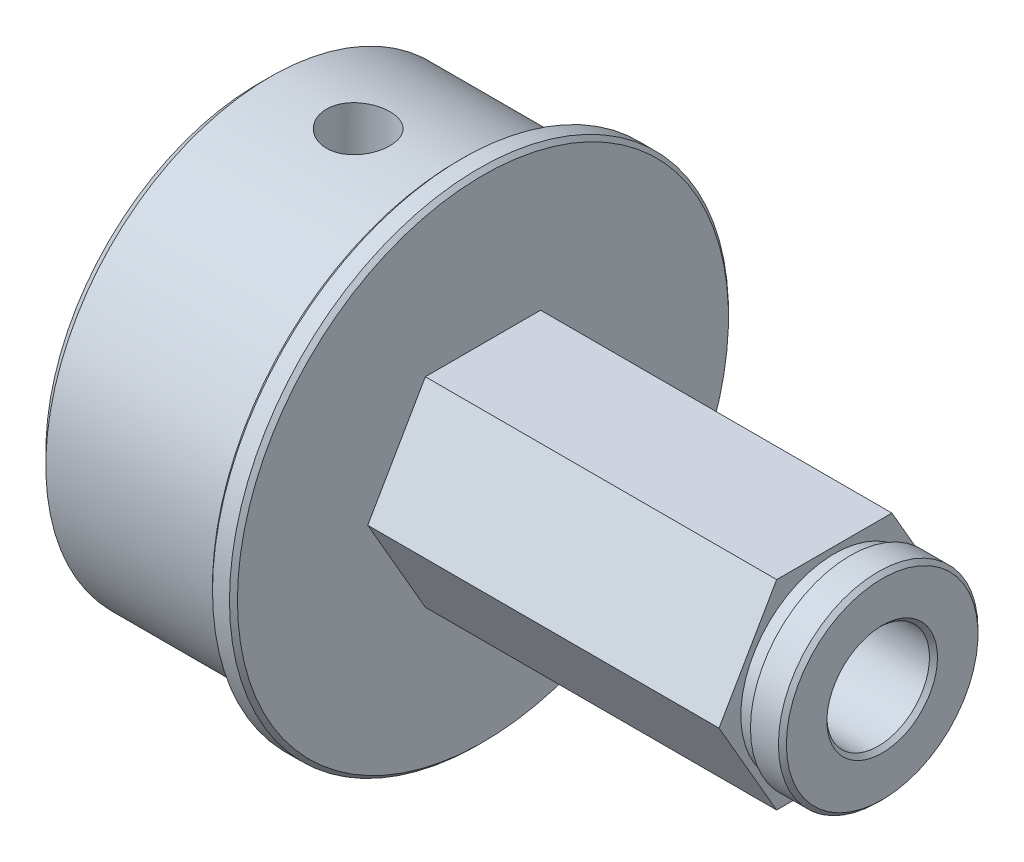
ISO-10303-21;
HEADER;
FILE_DESCRIPTION(('STEP AP214'),'2;1');
FILE_NAME('part.step','',(''),(''),'','','');
FILE_SCHEMA(('AUTOMOTIVE_DESIGN { 1 0 10303 214 1 1 1 1 }'));
ENDSEC;
DATA;
#1=APPLICATION_CONTEXT('core data for automotive mechanical design processes');
#2=APPLICATION_PROTOCOL_DEFINITION('international standard','automotive_design',2000,#1);
#3=PRODUCT_CONTEXT('',#1,'mechanical');
#4=PRODUCT('Part','Part','',(#3));
#5=PRODUCT_RELATED_PRODUCT_CATEGORY('part','',(#4));
#6=PRODUCT_DEFINITION_FORMATION('','',#4);
#7=PRODUCT_DEFINITION_CONTEXT('part definition',#1,'design');
#8=PRODUCT_DEFINITION('design','',#6,#7);
#9=PRODUCT_DEFINITION_SHAPE('','',#8);
#10=(LENGTH_UNIT() NAMED_UNIT(*) SI_UNIT(.MILLI.,.METRE.));
#11=(NAMED_UNIT(*) PLANE_ANGLE_UNIT() SI_UNIT($,.RADIAN.));
#12=(NAMED_UNIT(*) SI_UNIT($,.STERADIAN.) SOLID_ANGLE_UNIT());
#13=UNCERTAINTY_MEASURE_WITH_UNIT(LENGTH_MEASURE(1.E-05),#10,'distance_accuracy_value','');
#14=(GEOMETRIC_REPRESENTATION_CONTEXT(3) GLOBAL_UNCERTAINTY_ASSIGNED_CONTEXT((#13)) GLOBAL_UNIT_ASSIGNED_CONTEXT((#10,
#11,#12)) REPRESENTATION_CONTEXT('',''));
#15=CARTESIAN_POINT('',(0.,0.,0.));
#16=DIRECTION('',(0.,0.,1.));
#17=DIRECTION('',(1.,0.,0.));
#18=AXIS2_PLACEMENT_3D('',#15,#16,#17);
#19=CARTESIAN_POINT('',(26.9875,0.,0.));
#20=DIRECTION('',(1.,0.,0.));
#21=DIRECTION('',(0.,0.,-1.));
#22=AXIS2_PLACEMENT_3D('',#19,#20,#21);
#23=CYLINDRICAL_SURFACE('',#22,3.2639);
#24=CARTESIAN_POINT('',(-12.4460000000113,0.,0.));
#25=DIRECTION('',(-1.,0.,0.));
#26=DIRECTION('',(0.,0.,1.));
#27=AXIS2_PLACEMENT_3D('',#24,#25,#26);
#28=CIRCLE('',#27,3.26390000009269);
#29=CARTESIAN_POINT('',(-12.4460000000113,0.,3.26390000009269));
#30=VERTEX_POINT('',#29);
#31=EDGE_CURVE('E94',#30,#30,#28,.T.);
#32=ORIENTED_EDGE('',*,*,#31,.T.);
#33=EDGE_LOOP('',(#32));
#34=FACE_BOUND('',#33,.T.);
#35=CARTESIAN_POINT('',(26.7335000000344,0.,0.));
#36=DIRECTION('',(1.,0.,0.));
#37=DIRECTION('',(0.,0.,-1.));
#38=AXIS2_PLACEMENT_3D('',#35,#36,#37);
#39=CIRCLE('',#38,3.263899999979);
#40=CARTESIAN_POINT('',(26.7335000000344,0.,-3.263899999979));
#41=VERTEX_POINT('',#40);
#42=EDGE_CURVE('E91',#41,#41,#39,.T.);
#43=ORIENTED_EDGE('',*,*,#42,.T.);
#44=EDGE_LOOP('',(#43));
#45=FACE_BOUND('',#44,.T.);
#46=ADVANCED_FACE('F16',(#34,#45),#23,.F.);
#47=CARTESIAN_POINT('',(-12.6999999999953,0.,0.));
#48=DIRECTION('',(-1.,0.,0.));
#49=DIRECTION('',(0.,0.,1.));
#50=AXIS2_PLACEMENT_3D('',#47,#48,#49);
#51=CONICAL_SURFACE('',#50,3.51790000007668,0.785398163397448);
#52=CARTESIAN_POINT('',(-12.6999999999953,0.,0.));
#53=DIRECTION('',(-1.,0.,0.));
#54=DIRECTION('',(0.,0.,1.));
#55=AXIS2_PLACEMENT_3D('',#52,#53,#54);
#56=CIRCLE('',#55,3.51790000007668);
#57=CARTESIAN_POINT('',(-12.6999999999953,0.,3.51790000007668));
#58=VERTEX_POINT('',#57);
#59=EDGE_CURVE('E19',#58,#58,#56,.T.);
#60=ORIENTED_EDGE('',*,*,#59,.T.);
#61=EDGE_LOOP('',(#60));
#62=FACE_BOUND('',#61,.T.);
#63=ORIENTED_EDGE('',*,*,#31,.F.);
#64=EDGE_LOOP('',(#63));
#65=FACE_BOUND('',#64,.T.);
#66=ADVANCED_FACE('F256',(#62,#65),#51,.F.);
#67=CARTESIAN_POINT('',(26.9874999999047,0.,0.));
#68=DIRECTION('',(1.,0.,0.));
#69=DIRECTION('',(0.,0.,-1.));
#70=AXIS2_PLACEMENT_3D('',#67,#68,#69);
#71=CONICAL_SURFACE('',#70,3.51789999990615,0.785398163397448);
#72=ORIENTED_EDGE('',*,*,#42,.F.);
#73=EDGE_LOOP('',(#72));
#74=FACE_BOUND('',#73,.T.);
#75=CARTESIAN_POINT('',(26.9875000000184,0.,0.));
#76=DIRECTION('',(1.,0.,0.));
#77=DIRECTION('',(0.,0.,-1.));
#78=AXIS2_PLACEMENT_3D('',#75,#76,#77);
#79=CIRCLE('',#78,3.51790000001984);
#80=CARTESIAN_POINT('',(26.9875000000184,0.,-3.51790000001984));
#81=VERTEX_POINT('',#80);
#82=EDGE_CURVE('E83',#81,#81,#79,.F.);
#83=ORIENTED_EDGE('',*,*,#82,.F.);
#84=EDGE_LOOP('',(#83));
#85=FACE_BOUND('',#84,.T.);
#86=ADVANCED_FACE('F76',(#74,#85),#71,.F.);
#87=CARTESIAN_POINT('',(-6.35,-6.33729999992738,0.));
#88=DIRECTION('',(0.,-1.,0.));
#89=DIRECTION('',(0.,0.,-1.));
#90=AXIS2_PLACEMENT_3D('',#87,#88,#89);
#91=CONICAL_SURFACE('',#90,2.0192999998585,1.02974425857673);
#92=CARTESIAN_POINT('',(-6.35,-5.12398215195731,-5.68426412100906E-11));
#93=VERTEX_POINT('',#92);
#94=VERTEX_LOOP('',#93);
#95=FACE_BOUND('',#94,.T.);
#96=CARTESIAN_POINT('',(-6.35,-6.3373,0.));
#97=DIRECTION('',(0.,-1.,0.));
#98=DIRECTION('',(0.,0.,-1.));
#99=AXIS2_PLACEMENT_3D('',#96,#97,#98);
#100=CIRCLE('',#99,2.01929999999999);
#101=CARTESIAN_POINT('',(-6.35,-6.3373,-2.01929999999999));
#102=VERTEX_POINT('',#101);
#103=EDGE_CURVE('E80',#102,#102,#100,.T.);
#104=ORIENTED_EDGE('',*,*,#103,.T.);
#105=EDGE_LOOP('',(#104));
#106=FACE_BOUND('',#105,.T.);
#107=ADVANCED_FACE('F72',(#95,#106),#91,.F.);
#108=CARTESIAN_POINT('',(-6.35,6.33729999992738,0.));
#109=DIRECTION('',(0.,1.,0.));
#110=DIRECTION('',(0.,0.,1.));
#111=AXIS2_PLACEMENT_3D('',#108,#109,#110);
#112=CONICAL_SURFACE('',#111,2.0192999998585,1.02974425857673);
#113=CARTESIAN_POINT('',(-6.35,5.12398215195731,5.68441965115255E-11));
#114=VERTEX_POINT('',#113);
#115=VERTEX_LOOP('',#114);
#116=FACE_BOUND('',#115,.T.);
#117=CARTESIAN_POINT('',(-6.35,6.3373,0.));
#118=DIRECTION('',(0.,1.,0.));
#119=DIRECTION('',(0.,0.,1.));
#120=AXIS2_PLACEMENT_3D('',#117,#118,#119);
#121=CIRCLE('',#120,2.01929999999999);
#122=CARTESIAN_POINT('',(-6.35,6.3373,2.01929999999999));
#123=VERTEX_POINT('',#122);
#124=EDGE_CURVE('E82',#123,#123,#121,.T.);
#125=ORIENTED_EDGE('',*,*,#124,.T.);
#126=EDGE_LOOP('',(#125));
#127=FACE_BOUND('',#126,.T.);
#128=ADVANCED_FACE('F75',(#116,#127),#112,.F.);
#129=CARTESIAN_POINT('',(-12.7,0.,0.));
#130=DIRECTION('',(1.,0.,0.));
#131=DIRECTION('',(0.,0.,-1.));
#132=AXIS2_PLACEMENT_3D('',#129,#130,#131);
#133=PLANE('',#132);
#134=ORIENTED_EDGE('',*,*,#59,.F.);
#135=EDGE_LOOP('',(#134));
#136=FACE_BOUND('',#135,.T.);
#137=CARTESIAN_POINT('',(-12.7,0.,0.));
#138=DIRECTION('',(1.,0.,0.));
#139=DIRECTION('',(0.,0.,-1.));
#140=AXIS2_PLACEMENT_3D('',#137,#138,#139);
#141=CIRCLE('',#140,13.5255);
#142=CARTESIAN_POINT('',(-12.7,0.,-13.5255));
#143=VERTEX_POINT('',#142);
#144=EDGE_CURVE('E86',#143,#143,#141,.T.);
#145=ORIENTED_EDGE('',*,*,#144,.F.);
#146=EDGE_LOOP('',(#145));
#147=FACE_BOUND('',#146,.T.);
#148=ADVANCED_FACE('F241',(#136,#147),#133,.F.);
#149=CARTESIAN_POINT('',(26.9875,0.,0.));
#150=DIRECTION('',(1.,0.,0.));
#151=DIRECTION('',(0.,0.,-1.));
#152=AXIS2_PLACEMENT_3D('',#149,#150,#151);
#153=PLANE('',#152);
#154=ORIENTED_EDGE('',*,*,#82,.T.);
#155=EDGE_LOOP('',(#154));
#156=FACE_BOUND('',#155,.T.);
#157=CARTESIAN_POINT('',(26.9874999999615,0.,0.));
#158=DIRECTION('',(-1.,0.,0.));
#159=DIRECTION('',(0.,0.,1.));
#160=AXIS2_PLACEMENT_3D('',#157,#158,#159);
#161=CIRCLE('',#160,6.09600000001365);
#162=CARTESIAN_POINT('',(26.9874999999615,0.,6.09600000001365));
#163=VERTEX_POINT('',#162);
#164=EDGE_CURVE('E233',#163,#163,#161,.T.);
#165=ORIENTED_EDGE('',*,*,#164,.F.);
#166=EDGE_LOOP('',(#165));
#167=FACE_BOUND('',#166,.T.);
#168=ADVANCED_FACE('F243',(#156,#167),#153,.T.);
#169=CARTESIAN_POINT('',(-6.35,-14.2875,0.));
#170=DIRECTION('',(0.,-1.,0.));
#171=DIRECTION('',(0.,0.,-1.));
#172=AXIS2_PLACEMENT_3D('',#169,#170,#171);
#173=CYLINDRICAL_SURFACE('',#172,2.01929999999999);
#174=CARTESIAN_POINT('',(-6.35,-14.144082994666,-2.01929999999999));
#175=CARTESIAN_POINT('',(-6.46270978043252,-14.1440848572454,-2.01929494830352));
#176=CARTESIAN_POINT('',(-6.57556587894467,-14.1454458805024,-2.00982386080186));
#177=CARTESIAN_POINT('',(-6.7982088924763,-14.1507430375104,-1.97217534297388));
#178=CARTESIAN_POINT('',(-6.90798898861305,-14.1546844828974,-1.94395932562443));
#179=CARTESIAN_POINT('',(-7.12110470893202,-14.1646874218911,-1.86967410443429));
#180=CARTESIAN_POINT('',(-7.22444753490229,-14.1707464942905,-1.82362528341692));
#181=CARTESIAN_POINT('',(-7.42189406589667,-14.1842985714464,-1.71502478847225));
#182=CARTESIAN_POINT('',(-7.51600143849081,-14.1917910034744,-1.6524797022028));
#183=CARTESIAN_POINT('',(-7.69303462417489,-14.2074272342722,-1.51217328150928));
#184=CARTESIAN_POINT('',(-7.77588421230663,-14.2155749310997,-1.43431618488559));
#185=CARTESIAN_POINT('',(-7.92739205174378,-14.2315690971988,-1.26579893156019));
#186=CARTESIAN_POINT('',(-7.99604883392367,-14.2394155352181,-1.17513745108457));
#187=CARTESIAN_POINT('',(-8.11749018201473,-14.2539623529557,-0.983112202140051));
#188=CARTESIAN_POINT('',(-8.1702063573829,-14.2606577427863,-0.881704771543283));
#189=CARTESIAN_POINT('',(-8.25783082400248,-14.2721058154367,-0.671365971979823));
#190=CARTESIAN_POINT('',(-8.29274010812396,-14.2768586065682,-0.562435022891318));
#191=CARTESIAN_POINT('',(-8.34353419968075,-14.2838590054793,-0.34091159545971));
#192=CARTESIAN_POINT('',(-8.35954437028774,-14.28612311441,-0.228348392070303));
#193=CARTESIAN_POINT('',(-8.37247474096552,-14.2879475293366,-0.00211168387442444));
#194=CARTESIAN_POINT('',(-8.36939585590122,-14.2875079649092,0.111561767461445));
#195=CARTESIAN_POINT('',(-8.34433505905639,-14.2839878101692,0.335936542663667));
#196=CARTESIAN_POINT('',(-8.32248816809108,-14.2809260846932,0.446653285103089));
#197=CARTESIAN_POINT('',(-8.26072280300443,-14.272526639762,0.662834215513374));
#198=CARTESIAN_POINT('',(-8.2208037520711,-14.2671888476616,0.768298235713002));
#199=CARTESIAN_POINT('',(-8.12388550625377,-14.2548043308748,0.971394358653127));
#200=CARTESIAN_POINT('',(-8.06682832552566,-14.247751820225,1.06899842301094));
#201=CARTESIAN_POINT('',(-7.93730058817926,-14.2327257552402,1.25328969037924));
#202=CARTESIAN_POINT('',(-7.86483035509148,-14.2247522202398,1.3399771224765));
#203=CARTESIAN_POINT('',(-7.70579446431181,-14.2086932563854,1.5007629286406));
#204=CARTESIAN_POINT('',(-7.61911362555077,-14.200607453654,1.57474736975061));
#205=CARTESIAN_POINT('',(-7.43445909511833,-14.1852981969896,1.70717057678363));
#206=CARTESIAN_POINT('',(-7.3364802927051,-14.1780751363578,1.76560226741946));
#207=CARTESIAN_POINT('',(-7.13187256086239,-14.1653086919635,1.8652679033142));
#208=CARTESIAN_POINT('',(-7.02523133128519,-14.1597677514924,1.90647686483089));
#209=CARTESIAN_POINT('',(-6.80658871275593,-14.1510314499486,1.97028383212602));
#210=CARTESIAN_POINT('',(-6.69459920164276,-14.1478311271646,1.99292121896487));
#211=CARTESIAN_POINT('',(-6.5431885987086,-14.1453494339129,2.01041173449661));
#212=CARTESIAN_POINT('',(-6.5046324531641,-14.1448755243254,2.0137422538627));
#213=CARTESIAN_POINT('',(-6.42738995630406,-14.1442419848102,2.01818725463624));
#214=CARTESIAN_POINT('',(-6.38870360491022,-14.1440823550717,2.01930173471071));
#215=CARTESIAN_POINT('',(-6.23729021956748,-14.1440848572454,2.01929494830352));
#216=CARTESIAN_POINT('',(-6.12443412105533,-14.1454458805024,2.00982386080186));
#217=CARTESIAN_POINT('',(-5.9017911075237,-14.1507430375104,1.97217534297388));
#218=CARTESIAN_POINT('',(-5.79201101138695,-14.1546844828974,1.94395932562443));
#219=CARTESIAN_POINT('',(-5.57889529106798,-14.1646874218911,1.8696741044343));
#220=CARTESIAN_POINT('',(-5.47555246509771,-14.1707464942905,1.82362528341692));
#221=CARTESIAN_POINT('',(-5.27810593410334,-14.1842985714464,1.71502478847225));
#222=CARTESIAN_POINT('',(-5.18399856150919,-14.1917910034744,1.6524797022028));
#223=CARTESIAN_POINT('',(-5.00696537582511,-14.2074272342722,1.51217328150928));
#224=CARTESIAN_POINT('',(-4.92411578769338,-14.2155749310997,1.43431618488559));
#225=CARTESIAN_POINT('',(-4.77260794825623,-14.2315690971988,1.2657989315602));
#226=CARTESIAN_POINT('',(-4.70395116607633,-14.2394155352181,1.17513745108457));
#227=CARTESIAN_POINT('',(-4.58250981798527,-14.2539623529557,0.983112202140052));
#228=CARTESIAN_POINT('',(-4.5297936426171,-14.2606577427863,0.881704771543284));
#229=CARTESIAN_POINT('',(-4.44216917599753,-14.2721058154367,0.671365971979824));
#230=CARTESIAN_POINT('',(-4.40725989187604,-14.2768586065682,0.56243502289132));
#231=CARTESIAN_POINT('',(-4.35646580031926,-14.2838590054793,0.340911595459712));
#232=CARTESIAN_POINT('',(-4.34045562971226,-14.28612311441,0.228348392070305));
#233=CARTESIAN_POINT('',(-4.32752525903448,-14.2879475293366,0.00211168387442539));
#234=CARTESIAN_POINT('',(-4.33060414409879,-14.2875079649092,-0.111561767461444));
#235=CARTESIAN_POINT('',(-4.35566494094361,-14.2839878101692,-0.335936542663665));
#236=CARTESIAN_POINT('',(-4.37751183190892,-14.2809260846932,-0.446653285103088));
#237=CARTESIAN_POINT('',(-4.43927719699557,-14.272526639762,-0.662834215513373));
#238=CARTESIAN_POINT('',(-4.4791962479289,-14.2671888476616,-0.768298235713001));
#239=CARTESIAN_POINT('',(-4.57611449374623,-14.2548043308748,-0.971394358653126));
#240=CARTESIAN_POINT('',(-4.63317167447435,-14.247751820225,-1.06899842301094));
#241=CARTESIAN_POINT('',(-4.76269941182075,-14.2327257552402,-1.25328969037924));
#242=CARTESIAN_POINT('',(-4.83516964490853,-14.2247522202398,-1.3399771224765));
#243=CARTESIAN_POINT('',(-4.9942055356882,-14.2086932563854,-1.5007629286406));
#244=CARTESIAN_POINT('',(-5.08088637444924,-14.200607453654,-1.57474736975061));
#245=CARTESIAN_POINT('',(-5.26554090488167,-14.1852981969896,-1.70717057678363));
#246=CARTESIAN_POINT('',(-5.3635197072949,-14.1780751363578,-1.76560226741946));
#247=CARTESIAN_POINT('',(-5.56812743913762,-14.1653086919635,-1.8652679033142));
#248=CARTESIAN_POINT('',(-5.67476866871481,-14.1597677514924,-1.90647686483089));
#249=CARTESIAN_POINT('',(-5.89341128724408,-14.1510314499486,-1.97028383212601));
#250=CARTESIAN_POINT('',(-6.00540079835725,-14.1478311271646,-1.99292121896487));
#251=CARTESIAN_POINT('',(-6.1568114012914,-14.1453494339129,-2.01041173449661));
#252=CARTESIAN_POINT('',(-6.19536754683591,-14.1448755243254,-2.0137422538627));
#253=CARTESIAN_POINT('',(-6.27261004369595,-14.1442419848102,-2.01818725463624));
#254=CARTESIAN_POINT('',(-6.31129639508978,-14.1440823550717,-2.01930173471071));
#255=CARTESIAN_POINT('',(-6.35,-14.144082994666,-2.01929999999999));
#256=B_SPLINE_CURVE_WITH_KNOTS('',3,(#174,#175,#176,#177,#178,#179,#180,#181,#182,#183,#184,
#185,#186,#187,#188,#189,#190,#191,#192,#193,#194,#195,#196,#197,#198,#199,#200,#201,#202,#203,
#204,#205,#206,#207,#208,#209,#210,#211,#212,#213,#214,#215,#216,#217,#218,#219,#220,#221,#222,
#223,#224,#225,#226,#227,#228,#229,#230,#231,#232,#233,#234,#235,#236,#237,#238,#239,#240,#241,
#242,#243,#244,#245,#246,#247,#248,#249,#250,#251,#252,#253,#254,#255),.UNSPECIFIED.,.T.,.F.,(4,
2,2,2,2,2,2,2,2,2,2,2,2,2,2,2,2,2,2,2,2,2,2,2,2,2,2,2,2,2,2,2,2,2,2,2,2,2,2,2,4),(0.,
0.337981725405059,0.676661361564413,1.01495502540221,1.35311379825344,1.69345884511455,
2.03383910414603,2.37565963920306,2.71746111307282,3.05698234773836,3.39648731058473,
3.73357006716555,4.07066358322854,4.40891073452933,4.74715078649165,5.08828181598833,
5.42956776925378,5.77134709676019,6.11239979348322,6.22845984832776,6.34451997298379,
6.68250169838884,7.0211813345482,7.359474998386,7.69763377123723,8.03797881809834,
8.37835907712982,8.72017961218684,9.0619810860566,9.40150232072215,9.74100728356851,
10.0780900401493,10.4151835562123,10.7534307075131,11.0916707594754,11.4328017889721,
11.7740877422376,12.115867069744,12.456919766467,12.5729798213115,12.6890399459676),.UNSPECIFIED.);
#257=CARTESIAN_POINT('',(-6.35,-14.144082994666,-2.01929999999999));
#258=VERTEX_POINT('',#257);
#259=EDGE_CURVE('E128',#258,#258,#256,.T.);
#260=ORIENTED_EDGE('',*,*,#259,.F.);
#261=EDGE_LOOP('',(#260));
#262=FACE_BOUND('',#261,.T.);
#263=ORIENTED_EDGE('',*,*,#103,.F.);
#264=EDGE_LOOP('',(#263));
#265=FACE_BOUND('',#264,.T.);
#266=ADVANCED_FACE('F155',(#262,#265),#173,.F.);
#267=CARTESIAN_POINT('',(-6.35,14.2875,0.));
#268=DIRECTION('',(0.,1.,0.));
#269=DIRECTION('',(0.,0.,1.));
#270=AXIS2_PLACEMENT_3D('',#267,#268,#269);
#271=CYLINDRICAL_SURFACE('',#270,2.01929999999999);
#272=CARTESIAN_POINT('',(-6.35,14.144082994666,2.01929999999999));
#273=CARTESIAN_POINT('',(-6.46270978043252,14.1440848572454,2.01929494830352));
#274=CARTESIAN_POINT('',(-6.57556587894467,14.1454458805024,2.00982386080186));
#275=CARTESIAN_POINT('',(-6.7982088924763,14.1507430375104,1.97217534297388));
#276=CARTESIAN_POINT('',(-6.90798898861305,14.1546844828974,1.94395932562443));
#277=CARTESIAN_POINT('',(-7.12110470893202,14.1646874218911,1.8696741044343));
#278=CARTESIAN_POINT('',(-7.22444753490229,14.1707464942905,1.82362528341692));
#279=CARTESIAN_POINT('',(-7.42189406589666,14.1842985714464,1.71502478847225));
#280=CARTESIAN_POINT('',(-7.51600143849081,14.1917910034744,1.6524797022028));
#281=CARTESIAN_POINT('',(-7.69303462417489,14.2074272342722,1.51217328150928));
#282=CARTESIAN_POINT('',(-7.77588421230663,14.2155749310997,1.43431618488559));
#283=CARTESIAN_POINT('',(-7.92739205174378,14.2315690971988,1.2657989315602));
#284=CARTESIAN_POINT('',(-7.99604883392367,14.2394155352181,1.17513745108457));
#285=CARTESIAN_POINT('',(-8.11749018201473,14.2539623529557,0.983112202140053));
#286=CARTESIAN_POINT('',(-8.1702063573829,14.2606577427863,0.881704771543284));
#287=CARTESIAN_POINT('',(-8.25783082400248,14.2721058154367,0.671365971979825));
#288=CARTESIAN_POINT('',(-8.29274010812396,14.2768586065682,0.56243502289132));
#289=CARTESIAN_POINT('',(-8.34353419968075,14.2838590054793,0.340911595459712));
#290=CARTESIAN_POINT('',(-8.35954437028774,14.28612311441,0.228348392070305));
#291=CARTESIAN_POINT('',(-8.37247474096552,14.2879475293366,0.00211168387442576));
#292=CARTESIAN_POINT('',(-8.36939585590122,14.2875079649092,-0.111561767461443));
#293=CARTESIAN_POINT('',(-8.34433505905639,14.2839878101692,-0.335936542663665));
#294=CARTESIAN_POINT('',(-8.32248816809108,14.2809260846932,-0.446653285103087));
#295=CARTESIAN_POINT('',(-8.26072280300443,14.272526639762,-0.662834215513372));
#296=CARTESIAN_POINT('',(-8.2208037520711,14.2671888476616,-0.768298235713001));
#297=CARTESIAN_POINT('',(-8.12388550625377,14.2548043308748,-0.971394358653125));
#298=CARTESIAN_POINT('',(-8.06682832552566,14.247751820225,-1.06899842301094));
#299=CARTESIAN_POINT('',(-7.93730058817926,14.2327257552402,-1.25328969037924));
#300=CARTESIAN_POINT('',(-7.86483035509148,14.2247522202398,-1.3399771224765));
#301=CARTESIAN_POINT('',(-7.70579446431181,14.2086932563854,-1.5007629286406));
#302=CARTESIAN_POINT('',(-7.61911362555077,14.200607453654,-1.57474736975061));
#303=CARTESIAN_POINT('',(-7.43445909511833,14.1852981969896,-1.70717057678363));
#304=CARTESIAN_POINT('',(-7.3364802927051,14.1780751363578,-1.76560226741946));
#305=CARTESIAN_POINT('',(-7.13187256086239,14.1653086919635,-1.8652679033142));
#306=CARTESIAN_POINT('',(-7.02523133128519,14.1597677514924,-1.90647686483089));
#307=CARTESIAN_POINT('',(-6.80658871275593,14.1510314499486,-1.97028383212601));
#308=CARTESIAN_POINT('',(-6.69459920164276,14.1478311271646,-1.99292121896487));
#309=CARTESIAN_POINT('',(-6.5431885987086,14.1453494339129,-2.0104117344966));
#310=CARTESIAN_POINT('',(-6.5046324531641,14.1448755243254,-2.0137422538627));
#311=CARTESIAN_POINT('',(-6.42738995630406,14.1442419848102,-2.01818725463624));
#312=CARTESIAN_POINT('',(-6.38870360491022,14.1440823550717,-2.01930173471071));
#313=CARTESIAN_POINT('',(-6.23729021956748,14.1440848572454,-2.01929494830352));
#314=CARTESIAN_POINT('',(-6.12443412105533,14.1454458805024,-2.00982386080186));
#315=CARTESIAN_POINT('',(-5.9017911075237,14.1507430375104,-1.97217534297388));
#316=CARTESIAN_POINT('',(-5.79201101138695,14.1546844828974,-1.94395932562443));
#317=CARTESIAN_POINT('',(-5.57889529106798,14.1646874218911,-1.86967410443429));
#318=CARTESIAN_POINT('',(-5.47555246509771,14.1707464942905,-1.82362528341692));
#319=CARTESIAN_POINT('',(-5.27810593410334,14.1842985714464,-1.71502478847225));
#320=CARTESIAN_POINT('',(-5.18399856150919,14.1917910034744,-1.6524797022028));
#321=CARTESIAN_POINT('',(-5.00696537582511,14.2074272342722,-1.51217328150928));
#322=CARTESIAN_POINT('',(-4.92411578769338,14.2155749310997,-1.43431618488559));
#323=CARTESIAN_POINT('',(-4.77260794825623,14.2315690971988,-1.26579893156019));
#324=CARTESIAN_POINT('',(-4.70395116607633,14.2394155352181,-1.17513745108457));
#325=CARTESIAN_POINT('',(-4.58250981798527,14.2539623529557,-0.983112202140051));
#326=CARTESIAN_POINT('',(-4.5297936426171,14.2606577427863,-0.881704771543283));
#327=CARTESIAN_POINT('',(-4.44216917599753,14.2721058154367,-0.671365971979824));
#328=CARTESIAN_POINT('',(-4.40725989187604,14.2768586065682,-0.562435022891319));
#329=CARTESIAN_POINT('',(-4.35646580031926,14.2838590054793,-0.34091159545971));
#330=CARTESIAN_POINT('',(-4.34045562971226,14.28612311441,-0.228348392070304));
#331=CARTESIAN_POINT('',(-4.32752525903448,14.2879475293366,-0.00211168387442461));
#332=CARTESIAN_POINT('',(-4.33060414409879,14.2875079649092,0.111561767461445));
#333=CARTESIAN_POINT('',(-4.35566494094361,14.2839878101692,0.335936542663667));
#334=CARTESIAN_POINT('',(-4.37751183190892,14.2809260846932,0.446653285103088));
#335=CARTESIAN_POINT('',(-4.43927719699557,14.272526639762,0.662834215513374));
#336=CARTESIAN_POINT('',(-4.4791962479289,14.2671888476616,0.768298235713002));
#337=CARTESIAN_POINT('',(-4.57611449374623,14.2548043308748,0.971394358653127));
#338=CARTESIAN_POINT('',(-4.63317167447434,14.247751820225,1.06899842301094));
#339=CARTESIAN_POINT('',(-4.76269941182075,14.2327257552402,1.25328969037924));
#340=CARTESIAN_POINT('',(-4.83516964490852,14.2247522202398,1.3399771224765));
#341=CARTESIAN_POINT('',(-4.99420553568819,14.2086932563854,1.5007629286406));
#342=CARTESIAN_POINT('',(-5.08088637444923,14.200607453654,1.57474736975061));
#343=CARTESIAN_POINT('',(-5.26554090488167,14.1852981969896,1.70717057678363));
#344=CARTESIAN_POINT('',(-5.3635197072949,14.1780751363578,1.76560226741946));
#345=CARTESIAN_POINT('',(-5.56812743913762,14.1653086919635,1.8652679033142));
#346=CARTESIAN_POINT('',(-5.67476866871481,14.1597677514924,1.90647686483089));
#347=CARTESIAN_POINT('',(-5.89341128724408,14.1510314499486,1.97028383212602));
#348=CARTESIAN_POINT('',(-6.00540079835724,14.1478311271646,1.99292121896487));
#349=CARTESIAN_POINT('',(-6.1568114012914,14.1453494339129,2.01041173449661));
#350=CARTESIAN_POINT('',(-6.19536754683591,14.1448755243254,2.0137422538627));
#351=CARTESIAN_POINT('',(-6.27261004369595,14.1442419848102,2.01818725463624));
#352=CARTESIAN_POINT('',(-6.31129639508978,14.1440823550717,2.01930173471071));
#353=CARTESIAN_POINT('',(-6.35,14.144082994666,2.01929999999999));
#354=B_SPLINE_CURVE_WITH_KNOTS('',3,(#272,#273,#274,#275,#276,#277,#278,#279,#280,#281,#282,
#283,#284,#285,#286,#287,#288,#289,#290,#291,#292,#293,#294,#295,#296,#297,#298,#299,#300,#301,
#302,#303,#304,#305,#306,#307,#308,#309,#310,#311,#312,#313,#314,#315,#316,#317,#318,#319,#320,
#321,#322,#323,#324,#325,#326,#327,#328,#329,#330,#331,#332,#333,#334,#335,#336,#337,#338,#339,
#340,#341,#342,#343,#344,#345,#346,#347,#348,#349,#350,#351,#352,#353),.UNSPECIFIED.,.T.,.F.,(4,
2,2,2,2,2,2,2,2,2,2,2,2,2,2,2,2,2,2,2,2,2,2,2,2,2,2,2,2,2,2,2,2,2,2,2,2,2,2,2,4),(0.,
0.337981725405059,0.676661361564413,1.01495502540221,1.35311379825344,1.69345884511455,
2.03383910414603,2.37565963920306,2.71746111307282,3.05698234773836,3.39648731058473,
3.73357006716555,4.07066358322854,4.40891073452933,4.74715078649165,5.08828181598833,
5.42956776925377,5.77134709676019,6.11239979348321,6.22845984832776,6.34451997298378,
6.68250169838884,7.0211813345482,7.35947499838599,7.69763377123723,8.03797881809834,
8.37835907712982,8.72017961218684,9.0619810860566,9.40150232072215,9.74100728356851,
10.0780900401493,10.4151835562123,10.7534307075131,11.0916707594754,11.4328017889721,
11.7740877422376,12.115867069744,12.456919766467,12.5729798213115,12.6890399459676),.UNSPECIFIED.);
#355=CARTESIAN_POINT('',(-6.35,14.144082994666,2.01929999999999));
#356=VERTEX_POINT('',#355);
#357=EDGE_CURVE('E120',#356,#356,#354,.T.);
#358=ORIENTED_EDGE('',*,*,#357,.F.);
#359=EDGE_LOOP('',(#358));
#360=FACE_BOUND('',#359,.T.);
#361=ORIENTED_EDGE('',*,*,#124,.F.);
#362=EDGE_LOOP('',(#361));
#363=FACE_BOUND('',#362,.T.);
#364=ADVANCED_FACE('F133',(#360,#363),#271,.F.);
#365=CARTESIAN_POINT('',(-11.938,0.,0.));
#366=DIRECTION('',(1.,0.,0.));
#367=DIRECTION('',(0.,0.,-1.));
#368=AXIS2_PLACEMENT_3D('',#365,#366,#367);
#369=CONICAL_SURFACE('',#368,14.2875,0.785398163397455);
#370=CARTESIAN_POINT('',(-11.938,0.,0.));
#371=DIRECTION('',(1.,0.,0.));
#372=DIRECTION('',(0.,0.,-1.));
#373=AXIS2_PLACEMENT_3D('',#370,#371,#372);
#374=CIRCLE('',#373,14.2875);
#375=CARTESIAN_POINT('',(-11.938,0.,-14.2875));
#376=VERTEX_POINT('',#375);
#377=EDGE_CURVE('E127',#376,#376,#374,.T.);
#378=ORIENTED_EDGE('',*,*,#377,.F.);
#379=EDGE_LOOP('',(#378));
#380=FACE_BOUND('',#379,.T.);
#381=ORIENTED_EDGE('',*,*,#144,.T.);
#382=EDGE_LOOP('',(#381));
#383=FACE_BOUND('',#382,.T.);
#384=ADVANCED_FACE('F147',(#380,#383),#369,.T.);
#385=CARTESIAN_POINT('',(26.7334999999775,0.,0.));
#386=DIRECTION('',(-1.,0.,0.));
#387=DIRECTION('',(0.,0.,1.));
#388=AXIS2_PLACEMENT_3D('',#385,#386,#387);
#389=CONICAL_SURFACE('',#388,6.34999999999763,0.785398163397448);
#390=CARTESIAN_POINT('',(26.7335,0.,0.));
#391=DIRECTION('',(1.,0.,0.));
#392=DIRECTION('',(0.,0.,-1.));
#393=AXIS2_PLACEMENT_3D('',#390,#391,#392);
#394=CIRCLE('',#393,6.35);
#395=CARTESIAN_POINT('',(26.7335,0.,-6.35));
#396=VERTEX_POINT('',#395);
#397=EDGE_CURVE('E119',#396,#396,#394,.F.);
#398=ORIENTED_EDGE('',*,*,#397,.F.);
#399=EDGE_LOOP('',(#398));
#400=FACE_BOUND('',#399,.T.);
#401=ORIENTED_EDGE('',*,*,#164,.T.);
#402=EDGE_LOOP('',(#401));
#403=FACE_BOUND('',#402,.T.);
#404=ADVANCED_FACE('F142',(#400,#403),#389,.T.);
#405=CARTESIAN_POINT('',(-12.7,0.,0.));
#406=DIRECTION('',(1.,0.,0.));
#407=DIRECTION('',(0.,0.,-1.));
#408=AXIS2_PLACEMENT_3D('',#405,#406,#407);
#409=CYLINDRICAL_SURFACE('',#408,14.2875);
#410=CARTESIAN_POINT('',(0.,0.,0.));
#411=DIRECTION('',(1.,0.,0.));
#412=DIRECTION('',(0.,0.,-1.));
#413=AXIS2_PLACEMENT_3D('',#410,#411,#412);
#414=CIRCLE('',#413,14.2875);
#415=CARTESIAN_POINT('',(0.,0.,-14.2875));
#416=VERTEX_POINT('',#415);
#417=EDGE_CURVE('E116',#416,#416,#414,.F.);
#418=ORIENTED_EDGE('',*,*,#417,.T.);
#419=EDGE_LOOP('',(#418));
#420=FACE_BOUND('',#419,.T.);
#421=ORIENTED_EDGE('',*,*,#377,.T.);
#422=EDGE_LOOP('',(#421));
#423=FACE_BOUND('',#422,.T.);
#424=ORIENTED_EDGE('',*,*,#357,.T.);
#425=EDGE_LOOP('',(#424));
#426=FACE_BOUND('',#425,.T.);
#427=ORIENTED_EDGE('',*,*,#259,.T.);
#428=EDGE_LOOP('',(#427));
#429=FACE_BOUND('',#428,.T.);
#430=ADVANCED_FACE('F136',(#420,#423,#426,#429),#409,.T.);
#431=CARTESIAN_POINT('',(26.9875,0.,0.));
#432=DIRECTION('',(1.,0.,0.));
#433=DIRECTION('',(0.,0.,-1.));
#434=AXIS2_PLACEMENT_3D('',#431,#432,#433);
#435=CYLINDRICAL_SURFACE('',#434,6.35);
#436=ORIENTED_EDGE('',*,*,#397,.T.);
#437=EDGE_LOOP('',(#436));
#438=FACE_BOUND('',#437,.T.);
#439=CARTESIAN_POINT('',(24.9555,0.,0.));
#440=DIRECTION('',(1.,0.,0.));
#441=DIRECTION('',(0.,0.,-1.));
#442=AXIS2_PLACEMENT_3D('',#439,#440,#441);
#443=CIRCLE('',#442,6.35);
#444=CARTESIAN_POINT('',(24.9555,0.,-6.35));
#445=VERTEX_POINT('',#444);
#446=EDGE_CURVE('E113',#445,#445,#443,.T.);
#447=ORIENTED_EDGE('',*,*,#446,.T.);
#448=EDGE_LOOP('',(#447));
#449=FACE_BOUND('',#448,.T.);
#450=ADVANCED_FACE('F141',(#438,#449),#435,.T.);
#451=CARTESIAN_POINT('',(0.,0.,0.));
#452=DIRECTION('',(1.,0.,0.));
#453=DIRECTION('',(0.,0.,-1.));
#454=AXIS2_PLACEMENT_3D('',#451,#452,#453);
#455=PLANE('',#454);
#456=ORIENTED_EDGE('',*,*,#417,.F.);
#457=EDGE_LOOP('',(#456));
#458=FACE_BOUND('',#457,.T.);
#459=CARTESIAN_POINT('',(0.,0.,0.));
#460=DIRECTION('',(1.,0.,0.));
#461=DIRECTION('',(0.,0.,-1.));
#462=AXIS2_PLACEMENT_3D('',#459,#460,#461);
#463=CIRCLE('',#462,15.621);
#464=CARTESIAN_POINT('',(0.,0.,-15.621));
#465=VERTEX_POINT('',#464);
#466=EDGE_CURVE('E110',#465,#465,#463,.T.);
#467=ORIENTED_EDGE('',*,*,#466,.F.);
#468=EDGE_LOOP('',(#467));
#469=FACE_BOUND('',#468,.T.);
#470=ADVANCED_FACE('F213',(#458,#469),#455,.F.);
#471=CARTESIAN_POINT('',(24.9555,0.,0.));
#472=DIRECTION('',(1.,0.,0.));
#473=DIRECTION('',(0.,0.,-1.));
#474=AXIS2_PLACEMENT_3D('',#471,#472,#473);
#475=PLANE('',#474);
#476=CARTESIAN_POINT('',(24.9555,0.,0.));
#477=DIRECTION('',(1.,0.,0.));
#478=DIRECTION('',(0.,0.,-1.));
#479=AXIS2_PLACEMENT_3D('',#476,#477,#478);
#480=CIRCLE('',#479,5.9436);
#481=CARTESIAN_POINT('',(24.9555,0.,-5.9436));
#482=VERTEX_POINT('',#481);
#483=EDGE_CURVE('E107',#482,#482,#480,.F.);
#484=ORIENTED_EDGE('',*,*,#483,.F.);
#485=EDGE_LOOP('',(#484));
#486=FACE_BOUND('',#485,.T.);
#487=ORIENTED_EDGE('',*,*,#446,.F.);
#488=EDGE_LOOP('',(#487));
#489=FACE_BOUND('',#488,.T.);
#490=ADVANCED_FACE('F210',(#486,#489),#475,.F.);
#491=CARTESIAN_POINT('',(0.253999999999997,0.,0.));
#492=DIRECTION('',(1.,0.,0.));
#493=DIRECTION('',(0.,0.,-1.));
#494=AXIS2_PLACEMENT_3D('',#491,#492,#493);
#495=CONICAL_SURFACE('',#494,15.875,0.785398163397448);
#496=CARTESIAN_POINT('',(0.253999999999997,0.,0.));
#497=DIRECTION('',(-1.,0.,0.));
#498=DIRECTION('',(0.,0.,1.));
#499=AXIS2_PLACEMENT_3D('',#496,#497,#498);
#500=CIRCLE('',#499,15.875);
#501=CARTESIAN_POINT('',(0.253999999999997,0.,15.875));
#502=VERTEX_POINT('',#501);
#503=EDGE_CURVE('E106',#502,#502,#500,.F.);
#504=ORIENTED_EDGE('',*,*,#503,.F.);
#505=EDGE_LOOP('',(#504));
#506=FACE_BOUND('',#505,.T.);
#507=ORIENTED_EDGE('',*,*,#466,.T.);
#508=EDGE_LOOP('',(#507));
#509=FACE_BOUND('',#508,.T.);
#510=ADVANCED_FACE('F206',(#506,#509),#495,.T.);
#511=CARTESIAN_POINT('',(26.9875,0.,0.));
#512=DIRECTION('',(1.,0.,0.));
#513=DIRECTION('',(0.,0.,-1.));
#514=AXIS2_PLACEMENT_3D('',#511,#512,#513);
#515=CYLINDRICAL_SURFACE('',#514,5.9436);
#516=CARTESIAN_POINT('',(23.9395,0.,0.));
#517=DIRECTION('',(1.,0.,0.));
#518=DIRECTION('',(0.,0.,-1.));
#519=AXIS2_PLACEMENT_3D('',#516,#517,#518);
#520=CIRCLE('',#519,5.9436);
#521=CARTESIAN_POINT('',(23.9395,0.,-5.9436));
#522=VERTEX_POINT('',#521);
#523=EDGE_CURVE('E102',#522,#522,#520,.F.);
#524=ORIENTED_EDGE('',*,*,#523,.F.);
#525=EDGE_LOOP('',(#524));
#526=FACE_BOUND('',#525,.T.);
#527=ORIENTED_EDGE('',*,*,#483,.T.);
#528=EDGE_LOOP('',(#527));
#529=FACE_BOUND('',#528,.T.);
#530=ADVANCED_FACE('F202',(#526,#529),#515,.T.);
#531=CARTESIAN_POINT('',(1.5875,0.,0.));
#532=DIRECTION('',(-1.,0.,0.));
#533=DIRECTION('',(0.,0.,1.));
#534=AXIS2_PLACEMENT_3D('',#531,#532,#533);
#535=CYLINDRICAL_SURFACE('',#534,15.875);
#536=ORIENTED_EDGE('',*,*,#503,.T.);
#537=EDGE_LOOP('',(#536));
#538=FACE_BOUND('',#537,.T.);
#539=CARTESIAN_POINT('',(1.3335,0.,0.));
#540=DIRECTION('',(-1.,0.,0.));
#541=DIRECTION('',(0.,0.,1.));
#542=AXIS2_PLACEMENT_3D('',#539,#540,#541);
#543=CIRCLE('',#542,15.875);
#544=CARTESIAN_POINT('',(1.3335,0.,15.875));
#545=VERTEX_POINT('',#544);
#546=EDGE_CURVE('E105',#545,#545,#543,.F.);
#547=ORIENTED_EDGE('',*,*,#546,.F.);
#548=EDGE_LOOP('',(#547));
#549=FACE_BOUND('',#548,.T.);
#550=ADVANCED_FACE('F198',(#538,#549),#535,.T.);
#551=CARTESIAN_POINT('',(23.9395,0.,0.));
#552=DIRECTION('',(1.,0.,0.));
#553=DIRECTION('',(0.,0.,-1.));
#554=AXIS2_PLACEMENT_3D('',#551,#552,#553);
#555=PLANE('',#554);
#556=DIRECTION('',(0.,0.866025403784439,0.5));
#557=VECTOR('',#556,1.);
#558=CARTESIAN_POINT('',(23.9395,0.,7.33234841870824));
#559=LINE('',#558,#557);
#560=CARTESIAN_POINT('',(23.9395,0.,7.33234841870824));
#561=VERTEX_POINT('',#560);
#562=CARTESIAN_POINT('',(23.9395,-6.35,3.66617420935412));
#563=VERTEX_POINT('',#562);
#564=EDGE_CURVE('E469',#561,#563,#559,.F.);
#565=ORIENTED_EDGE('',*,*,#564,.T.);
#566=DIRECTION('',(0.,0.,1.));
#567=VECTOR('',#566,1.);
#568=CARTESIAN_POINT('',(23.9395,-6.35,3.66617420935412));
#569=LINE('',#568,#567);
#570=CARTESIAN_POINT('',(23.9395,-6.35,-3.66617420935413));
#571=VERTEX_POINT('',#570);
#572=EDGE_CURVE('E464',#563,#571,#569,.F.);
#573=ORIENTED_EDGE('',*,*,#572,.T.);
#574=DIRECTION('',(0.,-0.866025403784439,0.5));
#575=VECTOR('',#574,1.);
#576=CARTESIAN_POINT('',(23.9395,-6.35,-3.66617420935413));
#577=LINE('',#576,#575);
#578=CARTESIAN_POINT('',(23.9395,0.,-7.33234841870825));
#579=VERTEX_POINT('',#578);
#580=EDGE_CURVE('E459',#571,#579,#577,.F.);
#581=ORIENTED_EDGE('',*,*,#580,.T.);
#582=DIRECTION('',(0.,-0.866025403784439,-0.5));
#583=VECTOR('',#582,1.);
#584=CARTESIAN_POINT('',(23.9395,0.,-7.33234841870824));
#585=LINE('',#584,#583);
#586=CARTESIAN_POINT('',(23.9395,6.35,-3.66617420935412));
#587=VERTEX_POINT('',#586);
#588=EDGE_CURVE('E455',#579,#587,#585,.F.);
#589=ORIENTED_EDGE('',*,*,#588,.T.);
#590=DIRECTION('',(0.,0.,-1.));
#591=VECTOR('',#590,1.);
#592=CARTESIAN_POINT('',(23.9395,6.35,-3.66617420935412));
#593=LINE('',#592,#591);
#594=CARTESIAN_POINT('',(23.9395,6.35,3.66617420935412));
#595=VERTEX_POINT('',#594);
#596=EDGE_CURVE('E101',#587,#595,#593,.F.);
#597=ORIENTED_EDGE('',*,*,#596,.T.);
#598=DIRECTION('',(0.,0.866025403784439,-0.5));
#599=VECTOR('',#598,1.);
#600=CARTESIAN_POINT('',(23.9395,6.35,3.66617420935412));
#601=LINE('',#600,#599);
#602=EDGE_CURVE('E474',#595,#561,#601,.F.);
#603=ORIENTED_EDGE('',*,*,#602,.T.);
#604=EDGE_LOOP('',(#565,#573,#581,#589,#597,#603));
#605=FACE_BOUND('',#604,.T.);
#606=ORIENTED_EDGE('',*,*,#523,.T.);
#607=EDGE_LOOP('',(#606));
#608=FACE_BOUND('',#607,.T.);
#609=ADVANCED_FACE('F194',(#605,#608),#555,.T.);
#610=CARTESIAN_POINT('',(1.3335,0.,0.));
#611=DIRECTION('',(-1.,0.,0.));
#612=DIRECTION('',(0.,0.,1.));
#613=AXIS2_PLACEMENT_3D('',#610,#611,#612);
#614=CONICAL_SURFACE('',#613,15.875,0.785398163397449);
#615=ORIENTED_EDGE('',*,*,#546,.T.);
#616=EDGE_LOOP('',(#615));
#617=FACE_BOUND('',#616,.T.);
#618=CARTESIAN_POINT('',(1.5875,0.,0.));
#619=DIRECTION('',(-1.,0.,0.));
#620=DIRECTION('',(0.,0.,1.));
#621=AXIS2_PLACEMENT_3D('',#618,#619,#620);
#622=CIRCLE('',#621,15.621);
#623=CARTESIAN_POINT('',(1.5875,0.,15.621));
#624=VERTEX_POINT('',#623);
#625=EDGE_CURVE('E97',#624,#624,#622,.F.);
#626=ORIENTED_EDGE('',*,*,#625,.F.);
#627=EDGE_LOOP('',(#626));
#628=FACE_BOUND('',#627,.T.);
#629=ADVANCED_FACE('F190',(#617,#628),#614,.T.);
#630=CARTESIAN_POINT('',(26.9875,0.,-7.33234841870824));
#631=DIRECTION('',(0.,-0.5,0.866025403784439));
#632=DIRECTION('',(0.,-0.866025403784439,-0.5));
#633=AXIS2_PLACEMENT_3D('',#630,#631,#632);
#634=PLANE('',#633);
#635=DIRECTION('',(1.,0.,0.));
#636=VECTOR('',#635,1.);
#637=CARTESIAN_POINT('',(26.9875,0.,-7.33234841870825));
#638=LINE('',#637,#636);
#639=CARTESIAN_POINT('',(1.58749999999999,0.,-7.33234841870825));
#640=VERTEX_POINT('',#639);
#641=EDGE_CURVE('E457',#579,#640,#638,.F.);
#642=ORIENTED_EDGE('',*,*,#641,.T.);
#643=DIRECTION('',(0.,-0.866025403784438,-0.5));
#644=VECTOR('',#643,1.);
#645=CARTESIAN_POINT('',(1.5875,6.35,-3.66617420935412));
#646=LINE('',#645,#644);
#647=CARTESIAN_POINT('',(1.58749999999999,6.35,-3.66617420935412));
#648=VERTEX_POINT('',#647);
#649=EDGE_CURVE('E100',#648,#640,#646,.T.);
#650=ORIENTED_EDGE('',*,*,#649,.F.);
#651=DIRECTION('',(1.,0.,0.));
#652=VECTOR('',#651,1.);
#653=CARTESIAN_POINT('',(26.9875,6.35,-3.66617420935412));
#654=LINE('',#653,#652);
#655=EDGE_CURVE('E478',#648,#587,#654,.T.);
#656=ORIENTED_EDGE('',*,*,#655,.T.);
#657=ORIENTED_EDGE('',*,*,#588,.F.);
#658=EDGE_LOOP('',(#642,#650,#656,#657));
#659=FACE_BOUND('',#658,.T.);
#660=ADVANCED_FACE('F186',(#659),#634,.F.);
#661=CARTESIAN_POINT('',(26.9875,-6.35,-3.66617420935413));
#662=DIRECTION('',(0.,0.5,0.866025403784439));
#663=DIRECTION('',(0.,-0.866025403784439,0.5));
#664=AXIS2_PLACEMENT_3D('',#661,#662,#663);
#665=PLANE('',#664);
#666=DIRECTION('',(1.,0.,0.));
#667=VECTOR('',#666,1.);
#668=CARTESIAN_POINT('',(26.9875,-6.35,-3.66617420935413));
#669=LINE('',#668,#667);
#670=CARTESIAN_POINT('',(1.5875,-6.35,-3.66617420935413));
#671=VERTEX_POINT('',#670);
#672=EDGE_CURVE('E462',#571,#671,#669,.F.);
#673=ORIENTED_EDGE('',*,*,#672,.T.);
#674=DIRECTION('',(0.,-0.866025403784439,0.499999999999999));
#675=VECTOR('',#674,1.);
#676=CARTESIAN_POINT('',(1.5875,0.,-7.33234841870824));
#677=LINE('',#676,#675);
#678=EDGE_CURVE('E485',#640,#671,#677,.T.);
#679=ORIENTED_EDGE('',*,*,#678,.F.);
#680=ORIENTED_EDGE('',*,*,#641,.F.);
#681=ORIENTED_EDGE('',*,*,#580,.F.);
#682=EDGE_LOOP('',(#673,#679,#680,#681));
#683=FACE_BOUND('',#682,.T.);
#684=ADVANCED_FACE('F182',(#683),#665,.F.);
#685=CARTESIAN_POINT('',(26.9875,-6.35,3.66617420935412));
#686=DIRECTION('',(0.,1.,0.));
#687=DIRECTION('',(0.,0.,1.));
#688=AXIS2_PLACEMENT_3D('',#685,#686,#687);
#689=PLANE('',#688);
#690=DIRECTION('',(1.,0.,0.));
#691=VECTOR('',#690,1.);
#692=CARTESIAN_POINT('',(26.9875,-6.35,3.66617420935412));
#693=LINE('',#692,#691);
#694=CARTESIAN_POINT('',(1.5875,-6.35,3.66617420935412));
#695=VERTEX_POINT('',#694);
#696=EDGE_CURVE('E467',#563,#695,#693,.F.);
#697=ORIENTED_EDGE('',*,*,#696,.T.);
#698=DIRECTION('',(0.,0.,-1.));
#699=VECTOR('',#698,1.);
#700=CARTESIAN_POINT('',(1.5875,-6.35,0.));
#701=LINE('',#700,#699);
#702=EDGE_CURVE('E488',#671,#695,#701,.F.);
#703=ORIENTED_EDGE('',*,*,#702,.F.);
#704=ORIENTED_EDGE('',*,*,#672,.F.);
#705=ORIENTED_EDGE('',*,*,#572,.F.);
#706=EDGE_LOOP('',(#697,#703,#704,#705));
#707=FACE_BOUND('',#706,.T.);
#708=ADVANCED_FACE('F178',(#707),#689,.F.);
#709=CARTESIAN_POINT('',(26.9875,0.,7.33234841870824));
#710=DIRECTION('',(0.,0.5,-0.866025403784439));
#711=DIRECTION('',(0.,0.866025403784439,0.5));
#712=AXIS2_PLACEMENT_3D('',#709,#710,#711);
#713=PLANE('',#712);
#714=DIRECTION('',(1.,0.,0.));
#715=VECTOR('',#714,1.);
#716=CARTESIAN_POINT('',(26.9875,0.,7.33234841870825));
#717=LINE('',#716,#715);
#718=CARTESIAN_POINT('',(1.5875,0.,7.33234841870824));
#719=VERTEX_POINT('',#718);
#720=EDGE_CURVE('E472',#561,#719,#717,.F.);
#721=ORIENTED_EDGE('',*,*,#720,.T.);
#722=DIRECTION('',(0.,0.866025403784439,0.5));
#723=VECTOR('',#722,1.);
#724=CARTESIAN_POINT('',(1.5875,-6.35,3.66617420935412));
#725=LINE('',#724,#723);
#726=EDGE_CURVE('E491',#695,#719,#725,.T.);
#727=ORIENTED_EDGE('',*,*,#726,.F.);
#728=ORIENTED_EDGE('',*,*,#696,.F.);
#729=ORIENTED_EDGE('',*,*,#564,.F.);
#730=EDGE_LOOP('',(#721,#727,#728,#729));
#731=FACE_BOUND('',#730,.T.);
#732=ADVANCED_FACE('F175',(#731),#713,.F.);
#733=CARTESIAN_POINT('',(26.9875,6.35,3.66617420935412));
#734=DIRECTION('',(0.,-0.5,-0.866025403784439));
#735=DIRECTION('',(0.,0.866025403784439,-0.5));
#736=AXIS2_PLACEMENT_3D('',#733,#734,#735);
#737=PLANE('',#736);
#738=DIRECTION('',(1.,0.,0.));
#739=VECTOR('',#738,1.);
#740=CARTESIAN_POINT('',(26.9875,6.35,3.66617420935412));
#741=LINE('',#740,#739);
#742=CARTESIAN_POINT('',(1.58749999999999,6.35,3.66617420935412));
#743=VERTEX_POINT('',#742);
#744=EDGE_CURVE('E34',#595,#743,#741,.F.);
#745=ORIENTED_EDGE('',*,*,#744,.T.);
#746=DIRECTION('',(0.,0.866025403784439,-0.5));
#747=VECTOR('',#746,1.);
#748=CARTESIAN_POINT('',(1.5875,0.,7.33234841870824));
#749=LINE('',#748,#747);
#750=EDGE_CURVE('E25',#719,#743,#749,.T.);
#751=ORIENTED_EDGE('',*,*,#750,.F.);
#752=ORIENTED_EDGE('',*,*,#720,.F.);
#753=ORIENTED_EDGE('',*,*,#602,.F.);
#754=EDGE_LOOP('',(#745,#751,#752,#753));
#755=FACE_BOUND('',#754,.T.);
#756=ADVANCED_FACE('F167',(#755),#737,.F.);
#757=CARTESIAN_POINT('',(26.9875,6.35,-3.66617420935412));
#758=DIRECTION('',(0.,-1.,0.));
#759=DIRECTION('',(0.,0.,-1.));
#760=AXIS2_PLACEMENT_3D('',#757,#758,#759);
#761=PLANE('',#760);
#762=ORIENTED_EDGE('',*,*,#655,.F.);
#763=DIRECTION('',(0.,0.,-1.));
#764=VECTOR('',#763,1.);
#765=CARTESIAN_POINT('',(1.5875,6.35,0.));
#766=LINE('',#765,#764);
#767=EDGE_CURVE('E9',#743,#648,#766,.T.);
#768=ORIENTED_EDGE('',*,*,#767,.F.);
#769=ORIENTED_EDGE('',*,*,#744,.F.);
#770=ORIENTED_EDGE('',*,*,#596,.F.);
#771=EDGE_LOOP('',(#762,#768,#769,#770));
#772=FACE_BOUND('',#771,.T.);
#773=ADVANCED_FACE('F161',(#772),#761,.F.);
#774=CARTESIAN_POINT('',(1.5875,0.,0.));
#775=DIRECTION('',(1.,0.,0.));
#776=DIRECTION('',(0.,0.,-1.));
#777=AXIS2_PLACEMENT_3D('',#774,#775,#776);
#778=PLANE('',#777);
#779=ORIENTED_EDGE('',*,*,#750,.T.);
#780=ORIENTED_EDGE('',*,*,#767,.T.);
#781=ORIENTED_EDGE('',*,*,#649,.T.);
#782=ORIENTED_EDGE('',*,*,#678,.T.);
#783=ORIENTED_EDGE('',*,*,#702,.T.);
#784=ORIENTED_EDGE('',*,*,#726,.T.);
#785=EDGE_LOOP('',(#779,#780,#781,#782,#783,#784));
#786=FACE_BOUND('',#785,.T.);
#787=ORIENTED_EDGE('',*,*,#625,.T.);
#788=EDGE_LOOP('',(#787));
#789=FACE_BOUND('',#788,.T.);
#790=ADVANCED_FACE('F159',(#786,#789),#778,.T.);
#791=CLOSED_SHELL('',(#46,#66,#86,#107,#128,#148,#168,#266,#364,#384,#404,#430,#450,#470,#490,
#510,#530,#550,#609,#629,#660,#684,#708,#732,#756,#773,#790));
#792=MANIFOLD_SOLID_BREP('B1',#791);
#793=ADVANCED_BREP_SHAPE_REPRESENTATION('',(#18,#792),#14);
#794=SHAPE_DEFINITION_REPRESENTATION(#9,#793);
ENDSEC;
END-ISO-10303-21;
